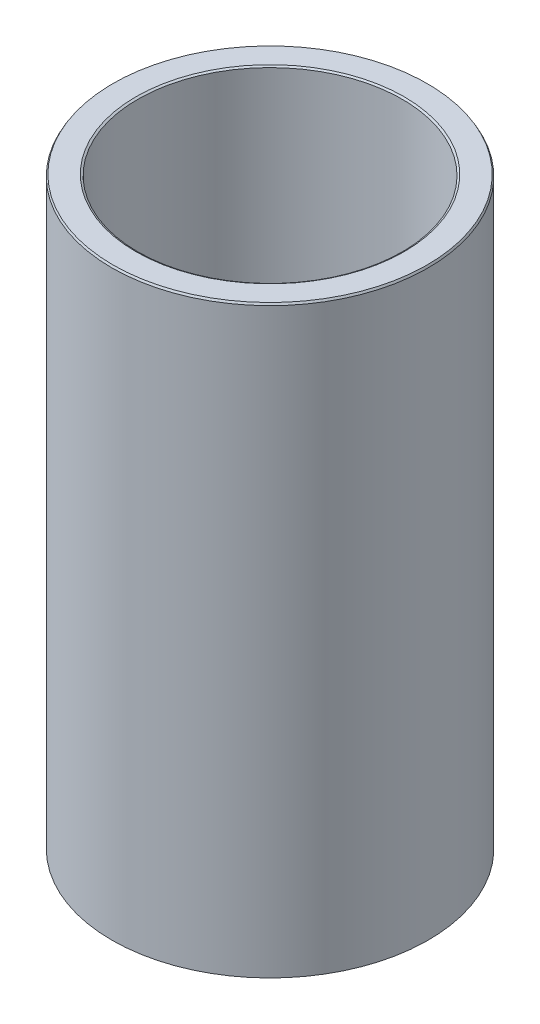
ISO-10303-21;
HEADER;
FILE_DESCRIPTION(('STEP AP214'),'2;1');
FILE_NAME('part.step','',(''),(''),'','','');
FILE_SCHEMA(('AUTOMOTIVE_DESIGN { 1 0 10303 214 1 1 1 1 }'));
ENDSEC;
DATA;
#1=APPLICATION_CONTEXT('core data for automotive mechanical design processes');
#2=APPLICATION_PROTOCOL_DEFINITION('international standard','automotive_design',2000,#1);
#3=PRODUCT_CONTEXT('',#1,'mechanical');
#4=PRODUCT('Part','Part','',(#3));
#5=PRODUCT_RELATED_PRODUCT_CATEGORY('part','',(#4));
#6=PRODUCT_DEFINITION_FORMATION('','',#4);
#7=PRODUCT_DEFINITION_CONTEXT('part definition',#1,'design');
#8=PRODUCT_DEFINITION('design','',#6,#7);
#9=PRODUCT_DEFINITION_SHAPE('','',#8);
#10=(LENGTH_UNIT() NAMED_UNIT(*) SI_UNIT(.MILLI.,.METRE.));
#11=(NAMED_UNIT(*) PLANE_ANGLE_UNIT() SI_UNIT($,.RADIAN.));
#12=(NAMED_UNIT(*) SI_UNIT($,.STERADIAN.) SOLID_ANGLE_UNIT());
#13=UNCERTAINTY_MEASURE_WITH_UNIT(LENGTH_MEASURE(1.E-05),#10,'distance_accuracy_value','');
#14=(GEOMETRIC_REPRESENTATION_CONTEXT(3) GLOBAL_UNCERTAINTY_ASSIGNED_CONTEXT((#13)) GLOBAL_UNIT_ASSIGNED_CONTEXT((#10,
#11,#12)) REPRESENTATION_CONTEXT('',''));
#15=CARTESIAN_POINT('',(0.,0.,0.));
#16=DIRECTION('',(0.,0.,1.));
#17=DIRECTION('',(1.,0.,0.));
#18=AXIS2_PLACEMENT_3D('',#15,#16,#17);
#19=CARTESIAN_POINT('',(0.,184.940125842379,0.));
#20=DIRECTION('',(0.,-1.,0.));
#21=DIRECTION('',(0.,0.,-1.));
#22=AXIS2_PLACEMENT_3D('',#19,#20,#21);
#23=CYLINDRICAL_SURFACE('',#22,50.);
#24=CARTESIAN_POINT('',(0.,0.355663462773603,0.));
#25=DIRECTION('',(0.,1.,0.));
#26=DIRECTION('',(0.,0.,1.));
#27=AXIS2_PLACEMENT_3D('',#24,#25,#26);
#28=CIRCLE('',#27,50.);
#29=CARTESIAN_POINT('',(0.,0.355663462773603,50.));
#30=VERTEX_POINT('',#29);
#31=EDGE_CURVE('E10',#30,#30,#28,.T.);
#32=ORIENTED_EDGE('',*,*,#31,.T.);
#33=EDGE_LOOP('',(#32));
#34=FACE_BOUND('',#33,.T.);
#35=CARTESIAN_POINT('',(0.,184.324098654459,0.));
#36=DIRECTION('',(0.,1.,0.));
#37=DIRECTION('',(0.,0.,1.));
#38=AXIS2_PLACEMENT_3D('',#35,#36,#37);
#39=CIRCLE('',#38,50.);
#40=CARTESIAN_POINT('',(0.,184.324098654459,50.));
#41=VERTEX_POINT('',#40);
#42=EDGE_CURVE('E50',#41,#41,#39,.F.);
#43=ORIENTED_EDGE('',*,*,#42,.T.);
#44=EDGE_LOOP('',(#43));
#45=FACE_BOUND('',#44,.T.);
#46=ADVANCED_FACE('F39',(#34,#45),#23,.T.);
#47=CARTESIAN_POINT('',(0.,184.940125842379,0.));
#48=DIRECTION('',(0.,1.,0.));
#49=DIRECTION('',(0.,0.,1.));
#50=AXIS2_PLACEMENT_3D('',#47,#48,#49);
#51=PLANE('',#50);
#52=CARTESIAN_POINT('',(0.,184.940125842379,0.));
#53=DIRECTION('',(0.,1.,0.));
#54=DIRECTION('',(0.,0.,1.));
#55=AXIS2_PLACEMENT_3D('',#52,#53,#54);
#56=CIRCLE('',#55,42.3929277249945);
#57=CARTESIAN_POINT('',(0.,184.940125842379,42.3929277249945));
#58=VERTEX_POINT('',#57);
#59=EDGE_CURVE('E58',#58,#58,#56,.F.);
#60=ORIENTED_EDGE('',*,*,#59,.T.);
#61=EDGE_LOOP('',(#60));
#62=FACE_BOUND('',#61,.T.);
#63=CARTESIAN_POINT('',(0.,184.940125842379,0.));
#64=DIRECTION('',(0.,1.,0.));
#65=DIRECTION('',(0.,0.,1.));
#66=AXIS2_PLACEMENT_3D('',#63,#64,#65);
#67=CIRCLE('',#66,49.6443365372264);
#68=CARTESIAN_POINT('',(0.,184.940125842379,49.6443365372264));
#69=VERTEX_POINT('',#68);
#70=EDGE_CURVE('E61',#69,#69,#67,.T.);
#71=ORIENTED_EDGE('',*,*,#70,.T.);
#72=EDGE_LOOP('',(#71));
#73=FACE_BOUND('',#72,.T.);
#74=ADVANCED_FACE('F88',(#62,#73),#51,.T.);
#75=CARTESIAN_POINT('',(0.,0.,0.));
#76=DIRECTION('',(0.,1.,0.));
#77=DIRECTION('',(0.,0.,1.));
#78=AXIS2_PLACEMENT_3D('',#75,#76,#77);
#79=PLANE('',#78);
#80=CARTESIAN_POINT('',(0.,0.,0.));
#81=DIRECTION('',(0.,1.,0.));
#82=DIRECTION('',(0.,0.,1.));
#83=AXIS2_PLACEMENT_3D('',#80,#81,#82);
#84=CIRCLE('',#83,42.1325639998484);
#85=CARTESIAN_POINT('',(0.,0.,42.1325639998484));
#86=VERTEX_POINT('',#85);
#87=EDGE_CURVE('E51',#86,#86,#84,.T.);
#88=ORIENTED_EDGE('',*,*,#87,.T.);
#89=EDGE_LOOP('',(#88));
#90=FACE_BOUND('',#89,.T.);
#91=CARTESIAN_POINT('',(0.,0.,0.));
#92=DIRECTION('',(0.,1.,0.));
#93=DIRECTION('',(0.,0.,1.));
#94=AXIS2_PLACEMENT_3D('',#91,#92,#93);
#95=CIRCLE('',#94,49.3839728120803);
#96=CARTESIAN_POINT('',(0.,0.,49.3839728120803));
#97=VERTEX_POINT('',#96);
#98=EDGE_CURVE('E54',#97,#97,#95,.F.);
#99=ORIENTED_EDGE('',*,*,#98,.T.);
#100=EDGE_LOOP('',(#99));
#101=FACE_BOUND('',#100,.T.);
#102=ADVANCED_FACE('F83',(#90,#101),#79,.F.);
#103=CARTESIAN_POINT('',(0.,184.940125842379,0.));
#104=DIRECTION('',(0.,-1.,0.));
#105=DIRECTION('',(0.,0.,-1.));
#106=AXIS2_PLACEMENT_3D('',#103,#104,#105);
#107=CYLINDRICAL_SURFACE('',#106,41.7769005370748);
#108=CARTESIAN_POINT('',(0.,184.584462379606,0.));
#109=DIRECTION('',(0.,1.,0.));
#110=DIRECTION('',(0.,0.,1.));
#111=AXIS2_PLACEMENT_3D('',#108,#109,#110);
#112=CIRCLE('',#111,41.7769005370748);
#113=CARTESIAN_POINT('',(0.,184.584462379606,41.7769005370748));
#114=VERTEX_POINT('',#113);
#115=EDGE_CURVE('E67',#114,#114,#112,.T.);
#116=ORIENTED_EDGE('',*,*,#115,.T.);
#117=EDGE_LOOP('',(#116));
#118=FACE_BOUND('',#117,.T.);
#119=CARTESIAN_POINT('',(0.,0.616027187919727,0.));
#120=DIRECTION('',(0.,1.,0.));
#121=DIRECTION('',(0.,0.,1.));
#122=AXIS2_PLACEMENT_3D('',#119,#120,#121);
#123=CIRCLE('',#122,41.7769005370748);
#124=CARTESIAN_POINT('',(0.,0.616027187919727,41.7769005370748));
#125=VERTEX_POINT('',#124);
#126=EDGE_CURVE('E69',#125,#125,#123,.F.);
#127=ORIENTED_EDGE('',*,*,#126,.T.);
#128=EDGE_LOOP('',(#127));
#129=FACE_BOUND('',#128,.T.);
#130=ADVANCED_FACE('F71',(#118,#129),#107,.F.);
#131=CARTESIAN_POINT('',(0.,184.584462379606,0.));
#132=DIRECTION('',(0.,1.,0.));
#133=DIRECTION('',(0.,0.,1.));
#134=AXIS2_PLACEMENT_3D('',#131,#132,#133);
#135=CONICAL_SURFACE('',#134,41.7769005370748,1.04719755119661);
#136=ORIENTED_EDGE('',*,*,#59,.F.);
#137=EDGE_LOOP('',(#136));
#138=FACE_BOUND('',#137,.T.);
#139=ORIENTED_EDGE('',*,*,#115,.F.);
#140=EDGE_LOOP('',(#139));
#141=FACE_BOUND('',#140,.T.);
#142=ADVANCED_FACE('F77',(#138,#141),#135,.F.);
#143=CARTESIAN_POINT('',(0.,0.,0.));
#144=DIRECTION('',(0.,-1.,0.));
#145=DIRECTION('',(0.,0.,-1.));
#146=AXIS2_PLACEMENT_3D('',#143,#144,#145);
#147=CONICAL_SURFACE('',#146,42.1325639998484,0.523598775598307);
#148=ORIENTED_EDGE('',*,*,#126,.F.);
#149=EDGE_LOOP('',(#148));
#150=FACE_BOUND('',#149,.T.);
#151=ORIENTED_EDGE('',*,*,#87,.F.);
#152=EDGE_LOOP('',(#151));
#153=FACE_BOUND('',#152,.T.);
#154=ADVANCED_FACE('F73',(#150,#153),#147,.F.);
#155=CARTESIAN_POINT('',(0.,0.355663462773603,0.));
#156=DIRECTION('',(0.,1.,0.));
#157=DIRECTION('',(0.,0.,1.));
#158=AXIS2_PLACEMENT_3D('',#155,#156,#157);
#159=CONICAL_SURFACE('',#158,50.,1.04719755119658);
#160=ORIENTED_EDGE('',*,*,#98,.F.);
#161=EDGE_LOOP('',(#160));
#162=FACE_BOUND('',#161,.T.);
#163=ORIENTED_EDGE('',*,*,#31,.F.);
#164=EDGE_LOOP('',(#163));
#165=FACE_BOUND('',#164,.T.);
#166=ADVANCED_FACE('F76',(#162,#165),#159,.T.);
#167=CARTESIAN_POINT('',(0.,184.940125842379,0.));
#168=DIRECTION('',(0.,-1.,0.));
#169=DIRECTION('',(0.,0.,-1.));
#170=AXIS2_PLACEMENT_3D('',#167,#168,#169);
#171=CONICAL_SURFACE('',#170,49.6443365372264,0.523598775598277);
#172=ORIENTED_EDGE('',*,*,#42,.F.);
#173=EDGE_LOOP('',(#172));
#174=FACE_BOUND('',#173,.T.);
#175=ORIENTED_EDGE('',*,*,#70,.F.);
#176=EDGE_LOOP('',(#175));
#177=FACE_BOUND('',#176,.T.);
#178=ADVANCED_FACE('F45',(#174,#177),#171,.T.);
#179=CLOSED_SHELL('',(#46,#74,#102,#130,#142,#154,#166,#178));
#180=MANIFOLD_SOLID_BREP('B2',#179);
#181=ADVANCED_BREP_SHAPE_REPRESENTATION('',(#18,#180),#14);
#182=SHAPE_DEFINITION_REPRESENTATION(#9,#181);
ENDSEC;
END-ISO-10303-21;
